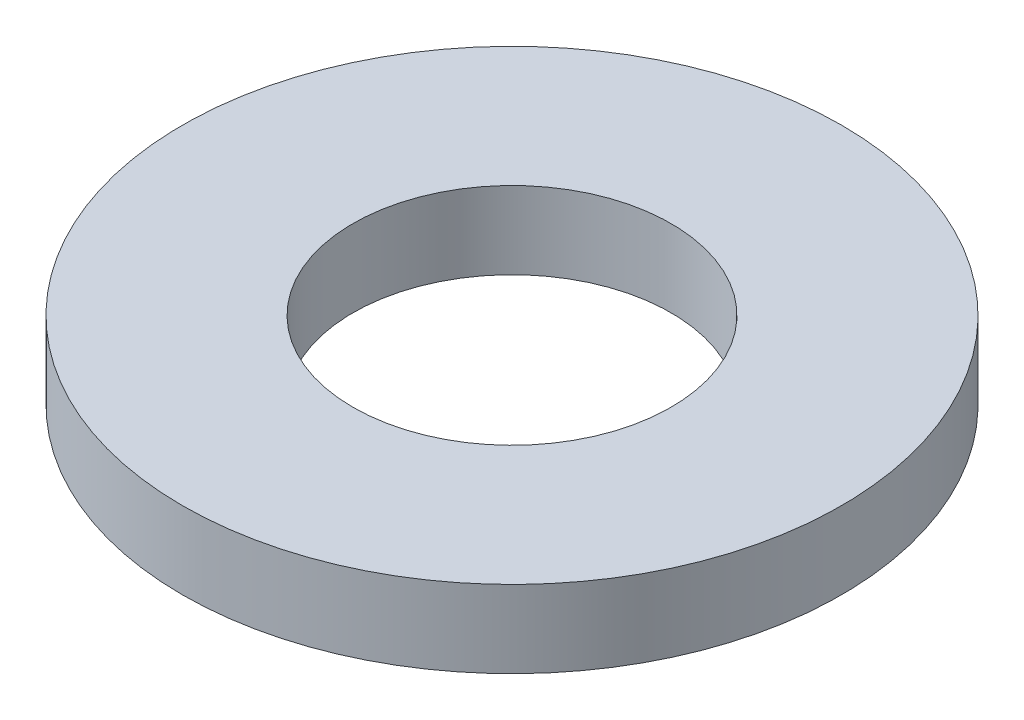
ISO-10303-21;
HEADER;
FILE_DESCRIPTION(('STEP AP214'),'2;1');
FILE_NAME('part.step','',(''),(''),'','','');
FILE_SCHEMA(('AUTOMOTIVE_DESIGN { 1 0 10303 214 1 1 1 1 }'));
ENDSEC;
DATA;
#1=APPLICATION_CONTEXT('core data for automotive mechanical design processes');
#2=APPLICATION_PROTOCOL_DEFINITION('international standard','automotive_design',2000,#1);
#3=PRODUCT_CONTEXT('',#1,'mechanical');
#4=PRODUCT('Part','Part','',(#3));
#5=PRODUCT_RELATED_PRODUCT_CATEGORY('part','',(#4));
#6=PRODUCT_DEFINITION_FORMATION('','',#4);
#7=PRODUCT_DEFINITION_CONTEXT('part definition',#1,'design');
#8=PRODUCT_DEFINITION('design','',#6,#7);
#9=PRODUCT_DEFINITION_SHAPE('','',#8);
#10=(LENGTH_UNIT() NAMED_UNIT(*) SI_UNIT(.MILLI.,.METRE.));
#11=(NAMED_UNIT(*) PLANE_ANGLE_UNIT() SI_UNIT($,.RADIAN.));
#12=(NAMED_UNIT(*) SI_UNIT($,.STERADIAN.) SOLID_ANGLE_UNIT());
#13=UNCERTAINTY_MEASURE_WITH_UNIT(LENGTH_MEASURE(1.E-05),#10,'distance_accuracy_value','');
#14=(GEOMETRIC_REPRESENTATION_CONTEXT(3) GLOBAL_UNCERTAINTY_ASSIGNED_CONTEXT((#13)) GLOBAL_UNIT_ASSIGNED_CONTEXT((#10,
#11,#12)) REPRESENTATION_CONTEXT('',''));
#15=CARTESIAN_POINT('',(0.,0.,0.));
#16=DIRECTION('',(0.,0.,1.));
#17=DIRECTION('',(1.,0.,0.));
#18=AXIS2_PLACEMENT_3D('',#15,#16,#17);
#19=CARTESIAN_POINT('',(0.,17.,0.));
#20=DIRECTION('',(0.,-1.,0.));
#21=DIRECTION('',(0.,0.,-1.));
#22=AXIS2_PLACEMENT_3D('',#19,#20,#21);
#23=CYLINDRICAL_SURFACE('',#22,72.5);
#24=CARTESIAN_POINT('',(0.,17.,0.));
#25=DIRECTION('',(0.,1.,0.));
#26=DIRECTION('',(0.,0.,1.));
#27=AXIS2_PLACEMENT_3D('',#24,#25,#26);
#28=CIRCLE('',#27,72.5);
#29=CARTESIAN_POINT('',(0.,17.,72.5));
#30=VERTEX_POINT('',#29);
#31=EDGE_CURVE('E10',#30,#30,#28,.T.);
#32=ORIENTED_EDGE('',*,*,#31,.F.);
#33=EDGE_LOOP('',(#32));
#34=FACE_BOUND('',#33,.T.);
#35=CARTESIAN_POINT('',(0.,0.,0.));
#36=DIRECTION('',(0.,1.,0.));
#37=DIRECTION('',(0.,0.,1.));
#38=AXIS2_PLACEMENT_3D('',#35,#36,#37);
#39=CIRCLE('',#38,72.5);
#40=CARTESIAN_POINT('',(0.,0.,72.5));
#41=VERTEX_POINT('',#40);
#42=EDGE_CURVE('E37',#41,#41,#39,.T.);
#43=ORIENTED_EDGE('',*,*,#42,.T.);
#44=EDGE_LOOP('',(#43));
#45=FACE_BOUND('',#44,.T.);
#46=ADVANCED_FACE('F40',(#34,#45),#23,.T.);
#47=CARTESIAN_POINT('',(0.,17.,0.));
#48=DIRECTION('',(0.,1.,0.));
#49=DIRECTION('',(0.,0.,1.));
#50=AXIS2_PLACEMENT_3D('',#47,#48,#49);
#51=PLANE('',#50);
#52=CARTESIAN_POINT('',(0.,17.,0.));
#53=DIRECTION('',(0.,1.,0.));
#54=DIRECTION('',(0.,0.,1.));
#55=AXIS2_PLACEMENT_3D('',#52,#53,#54);
#56=CIRCLE('',#55,35.);
#57=CARTESIAN_POINT('',(0.,17.,35.));
#58=VERTEX_POINT('',#57);
#59=EDGE_CURVE('E50',#58,#58,#56,.T.);
#60=ORIENTED_EDGE('',*,*,#59,.F.);
#61=EDGE_LOOP('',(#60));
#62=FACE_BOUND('',#61,.T.);
#63=ORIENTED_EDGE('',*,*,#31,.T.);
#64=EDGE_LOOP('',(#63));
#65=FACE_BOUND('',#64,.T.);
#66=ADVANCED_FACE('F59',(#62,#65),#51,.T.);
#67=CARTESIAN_POINT('',(0.,0.,0.));
#68=DIRECTION('',(0.,1.,0.));
#69=DIRECTION('',(0.,0.,1.));
#70=AXIS2_PLACEMENT_3D('',#67,#68,#69);
#71=PLANE('',#70);
#72=CARTESIAN_POINT('',(0.,0.,0.));
#73=DIRECTION('',(0.,1.,0.));
#74=DIRECTION('',(0.,0.,1.));
#75=AXIS2_PLACEMENT_3D('',#72,#73,#74);
#76=CIRCLE('',#75,35.);
#77=CARTESIAN_POINT('',(0.,0.,35.));
#78=VERTEX_POINT('',#77);
#79=EDGE_CURVE('E47',#78,#78,#76,.T.);
#80=ORIENTED_EDGE('',*,*,#79,.T.);
#81=EDGE_LOOP('',(#80));
#82=FACE_BOUND('',#81,.T.);
#83=ORIENTED_EDGE('',*,*,#42,.F.);
#84=EDGE_LOOP('',(#83));
#85=FACE_BOUND('',#84,.T.);
#86=ADVANCED_FACE('F58',(#82,#85),#71,.F.);
#87=CARTESIAN_POINT('',(0.,17.,0.));
#88=DIRECTION('',(0.,-1.,0.));
#89=DIRECTION('',(0.,0.,-1.));
#90=AXIS2_PLACEMENT_3D('',#87,#88,#89);
#91=CYLINDRICAL_SURFACE('',#90,35.);
#92=ORIENTED_EDGE('',*,*,#59,.T.);
#93=EDGE_LOOP('',(#92));
#94=FACE_BOUND('',#93,.T.);
#95=ORIENTED_EDGE('',*,*,#79,.F.);
#96=EDGE_LOOP('',(#95));
#97=FACE_BOUND('',#96,.T.);
#98=ADVANCED_FACE('F54',(#94,#97),#91,.F.);
#99=CLOSED_SHELL('',(#46,#66,#86,#98));
#100=MANIFOLD_SOLID_BREP('B2',#99);
#101=ADVANCED_BREP_SHAPE_REPRESENTATION('',(#18,#100),#14);
#102=SHAPE_DEFINITION_REPRESENTATION(#9,#101);
ENDSEC;
END-ISO-10303-21;
